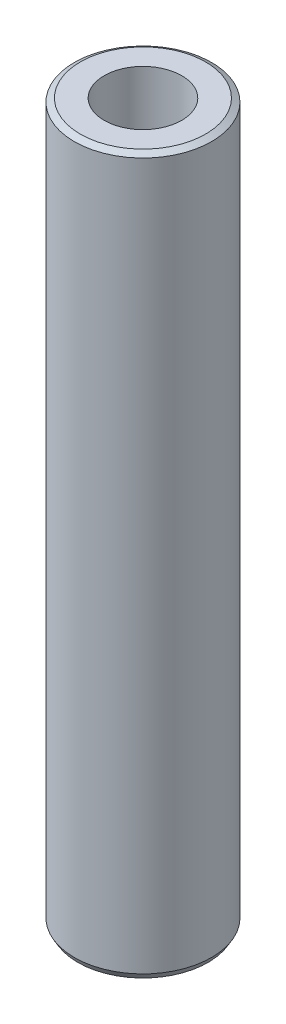
ISO-10303-21;
HEADER;
FILE_DESCRIPTION(('STEP AP214'),'2;1');
FILE_NAME('part.step','',(''),(''),'','','');
FILE_SCHEMA(('AUTOMOTIVE_DESIGN { 1 0 10303 214 1 1 1 1 }'));
ENDSEC;
DATA;
#1=APPLICATION_CONTEXT('core data for automotive mechanical design processes');
#2=APPLICATION_PROTOCOL_DEFINITION('international standard','automotive_design',2000,#1);
#3=PRODUCT_CONTEXT('',#1,'mechanical');
#4=PRODUCT('Part','Part','',(#3));
#5=PRODUCT_RELATED_PRODUCT_CATEGORY('part','',(#4));
#6=PRODUCT_DEFINITION_FORMATION('','',#4);
#7=PRODUCT_DEFINITION_CONTEXT('part definition',#1,'design');
#8=PRODUCT_DEFINITION('design','',#6,#7);
#9=PRODUCT_DEFINITION_SHAPE('','',#8);
#10=(LENGTH_UNIT() NAMED_UNIT(*) SI_UNIT(.MILLI.,.METRE.));
#11=(NAMED_UNIT(*) PLANE_ANGLE_UNIT() SI_UNIT($,.RADIAN.));
#12=(NAMED_UNIT(*) SI_UNIT($,.STERADIAN.) SOLID_ANGLE_UNIT());
#13=UNCERTAINTY_MEASURE_WITH_UNIT(LENGTH_MEASURE(1.E-05),#10,'distance_accuracy_value','');
#14=(GEOMETRIC_REPRESENTATION_CONTEXT(3) GLOBAL_UNCERTAINTY_ASSIGNED_CONTEXT((#13)) GLOBAL_UNIT_ASSIGNED_CONTEXT((#10,
#11,#12)) REPRESENTATION_CONTEXT('',''));
#15=CARTESIAN_POINT('',(0.,0.,0.));
#16=DIRECTION('',(0.,0.,1.));
#17=DIRECTION('',(1.,0.,0.));
#18=AXIS2_PLACEMENT_3D('',#15,#16,#17);
#19=CARTESIAN_POINT('',(0.,600.,0.));
#20=DIRECTION('',(0.,-1.,0.));
#21=DIRECTION('',(0.,0.,-1.));
#22=AXIS2_PLACEMENT_3D('',#19,#20,#21);
#23=CYLINDRICAL_SURFACE('',#22,57.5);
#24=CARTESIAN_POINT('',(0.,597.089066148709,0.));
#25=DIRECTION('',(0.,1.,0.));
#26=DIRECTION('',(0.,0.,1.));
#27=AXIS2_PLACEMENT_3D('',#24,#25,#26);
#28=CIRCLE('',#27,57.5);
#29=CARTESIAN_POINT('',(0.,597.089066148709,57.5));
#30=VERTEX_POINT('',#29);
#31=EDGE_CURVE('E50',#30,#30,#28,.F.);
#32=ORIENTED_EDGE('',*,*,#31,.T.);
#33=EDGE_LOOP('',(#32));
#34=FACE_BOUND('',#33,.T.);
#35=CARTESIAN_POINT('',(0.,5.04188532790917,0.));
#36=DIRECTION('',(0.,1.,0.));
#37=DIRECTION('',(0.,0.,1.));
#38=AXIS2_PLACEMENT_3D('',#35,#36,#37);
#39=CIRCLE('',#38,57.5);
#40=CARTESIAN_POINT('',(0.,5.04188532790917,57.5));
#41=VERTEX_POINT('',#40);
#42=EDGE_CURVE('E51',#41,#41,#39,.T.);
#43=ORIENTED_EDGE('',*,*,#42,.T.);
#44=EDGE_LOOP('',(#43));
#45=FACE_BOUND('',#44,.T.);
#46=ADVANCED_FACE('F39',(#34,#45),#23,.T.);
#47=CARTESIAN_POINT('',(0.,600.,0.));
#48=DIRECTION('',(0.,1.,0.));
#49=DIRECTION('',(0.,0.,1.));
#50=AXIS2_PLACEMENT_3D('',#47,#48,#49);
#51=PLANE('',#50);
#52=CARTESIAN_POINT('',(0.,600.,0.));
#53=DIRECTION('',(0.,1.,0.));
#54=DIRECTION('',(0.,0.,1.));
#55=AXIS2_PLACEMENT_3D('',#52,#53,#54);
#56=CIRCLE('',#55,52.4581146720912);
#57=CARTESIAN_POINT('',(0.,600.,52.4581146720912));
#58=VERTEX_POINT('',#57);
#59=EDGE_CURVE('E54',#58,#58,#56,.T.);
#60=ORIENTED_EDGE('',*,*,#59,.T.);
#61=EDGE_LOOP('',(#60));
#62=FACE_BOUND('',#61,.T.);
#63=CARTESIAN_POINT('',(0.,600.,0.));
#64=DIRECTION('',(0.,1.,0.));
#65=DIRECTION('',(0.,0.,1.));
#66=AXIS2_PLACEMENT_3D('',#63,#64,#65);
#67=CIRCLE('',#66,32.4916444952505);
#68=CARTESIAN_POINT('',(0.,600.,32.4916444952505));
#69=VERTEX_POINT('',#68);
#70=EDGE_CURVE('E58',#69,#69,#67,.T.);
#71=ORIENTED_EDGE('',*,*,#70,.F.);
#72=EDGE_LOOP('',(#71));
#73=FACE_BOUND('',#72,.T.);
#74=ADVANCED_FACE('F69',(#62,#73),#51,.T.);
#75=CARTESIAN_POINT('',(0.,0.,0.));
#76=DIRECTION('',(0.,1.,0.));
#77=DIRECTION('',(0.,0.,1.));
#78=AXIS2_PLACEMENT_3D('',#75,#76,#77);
#79=PLANE('',#78);
#80=CARTESIAN_POINT('',(0.,0.,0.));
#81=DIRECTION('',(0.,1.,0.));
#82=DIRECTION('',(0.,0.,1.));
#83=AXIS2_PLACEMENT_3D('',#80,#81,#82);
#84=CIRCLE('',#83,54.5890661487084);
#85=CARTESIAN_POINT('',(0.,0.,54.5890661487084));
#86=VERTEX_POINT('',#85);
#87=EDGE_CURVE('E10',#86,#86,#84,.F.);
#88=ORIENTED_EDGE('',*,*,#87,.T.);
#89=EDGE_LOOP('',(#88));
#90=FACE_BOUND('',#89,.T.);
#91=CARTESIAN_POINT('',(0.,0.,0.));
#92=DIRECTION('',(0.,1.,0.));
#93=DIRECTION('',(0.,0.,1.));
#94=AXIS2_PLACEMENT_3D('',#91,#92,#93);
#95=CIRCLE('',#94,32.4916444952505);
#96=CARTESIAN_POINT('',(0.,0.,32.4916444952505));
#97=VERTEX_POINT('',#96);
#98=EDGE_CURVE('E63',#97,#97,#95,.T.);
#99=ORIENTED_EDGE('',*,*,#98,.T.);
#100=EDGE_LOOP('',(#99));
#101=FACE_BOUND('',#100,.T.);
#102=ADVANCED_FACE('F75',(#90,#101),#79,.F.);
#103=CARTESIAN_POINT('',(0.,600.,0.));
#104=DIRECTION('',(0.,-1.,0.));
#105=DIRECTION('',(0.,0.,-1.));
#106=AXIS2_PLACEMENT_3D('',#103,#104,#105);
#107=CYLINDRICAL_SURFACE('',#106,32.4916444952505);
#108=ORIENTED_EDGE('',*,*,#70,.T.);
#109=EDGE_LOOP('',(#108));
#110=FACE_BOUND('',#109,.T.);
#111=ORIENTED_EDGE('',*,*,#98,.F.);
#112=EDGE_LOOP('',(#111));
#113=FACE_BOUND('',#112,.T.);
#114=ADVANCED_FACE('F70',(#110,#113),#107,.F.);
#115=CARTESIAN_POINT('',(0.,600.,0.));
#116=DIRECTION('',(0.,-1.,0.));
#117=DIRECTION('',(0.,0.,-1.));
#118=AXIS2_PLACEMENT_3D('',#115,#116,#117);
#119=CONICAL_SURFACE('',#118,52.4581146720912,1.0471975511966);
#120=ORIENTED_EDGE('',*,*,#31,.F.);
#121=EDGE_LOOP('',(#120));
#122=FACE_BOUND('',#121,.T.);
#123=ORIENTED_EDGE('',*,*,#59,.F.);
#124=EDGE_LOOP('',(#123));
#125=FACE_BOUND('',#124,.T.);
#126=ADVANCED_FACE('F81',(#122,#125),#119,.T.);
#127=CARTESIAN_POINT('',(0.,5.04188532790917,0.));
#128=DIRECTION('',(0.,1.,0.));
#129=DIRECTION('',(0.,0.,1.));
#130=AXIS2_PLACEMENT_3D('',#127,#128,#129);
#131=CONICAL_SURFACE('',#130,57.5,0.523598775598302);
#132=ORIENTED_EDGE('',*,*,#87,.F.);
#133=EDGE_LOOP('',(#132));
#134=FACE_BOUND('',#133,.T.);
#135=ORIENTED_EDGE('',*,*,#42,.F.);
#136=EDGE_LOOP('',(#135));
#137=FACE_BOUND('',#136,.T.);
#138=ADVANCED_FACE('F45',(#134,#137),#131,.T.);
#139=CLOSED_SHELL('',(#46,#74,#102,#114,#126,#138));
#140=MANIFOLD_SOLID_BREP('B2',#139);
#141=ADVANCED_BREP_SHAPE_REPRESENTATION('',(#18,#140),#14);
#142=SHAPE_DEFINITION_REPRESENTATION(#9,#141);
ENDSEC;
END-ISO-10303-21;
